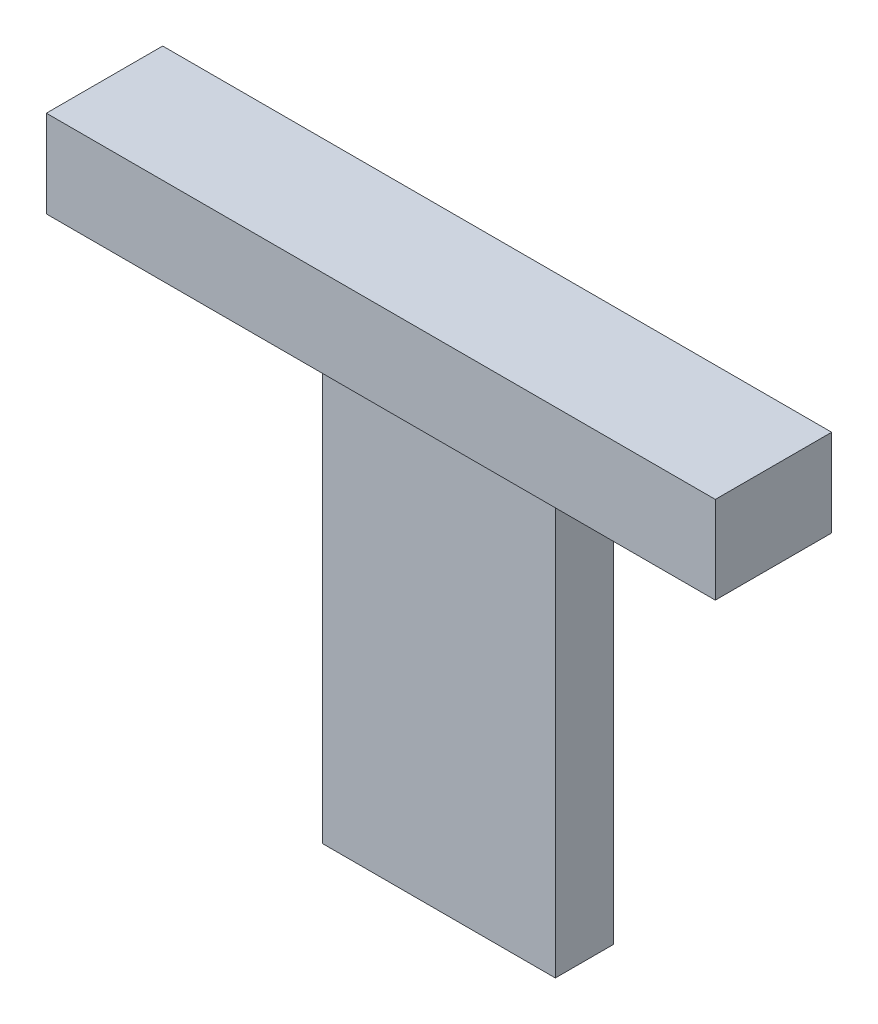
ISO-10303-21;
HEADER;
FILE_DESCRIPTION(('STEP AP214'),'2;1');
FILE_NAME('part.step','',(''),(''),'','','');
FILE_SCHEMA(('AUTOMOTIVE_DESIGN { 1 0 10303 214 1 1 1 1 }'));
ENDSEC;
DATA;
#1=APPLICATION_CONTEXT('core data for automotive mechanical design processes');
#2=APPLICATION_PROTOCOL_DEFINITION('international standard','automotive_design',2000,#1);
#3=PRODUCT_CONTEXT('',#1,'mechanical');
#4=PRODUCT('Part','Part','',(#3));
#5=PRODUCT_RELATED_PRODUCT_CATEGORY('part','',(#4));
#6=PRODUCT_DEFINITION_FORMATION('','',#4);
#7=PRODUCT_DEFINITION_CONTEXT('part definition',#1,'design');
#8=PRODUCT_DEFINITION('design','',#6,#7);
#9=PRODUCT_DEFINITION_SHAPE('','',#8);
#10=(LENGTH_UNIT() NAMED_UNIT(*) SI_UNIT(.MILLI.,.METRE.));
#11=(NAMED_UNIT(*) PLANE_ANGLE_UNIT() SI_UNIT($,.RADIAN.));
#12=(NAMED_UNIT(*) SI_UNIT($,.STERADIAN.) SOLID_ANGLE_UNIT());
#13=UNCERTAINTY_MEASURE_WITH_UNIT(LENGTH_MEASURE(1.E-05),#10,'distance_accuracy_value','');
#14=(GEOMETRIC_REPRESENTATION_CONTEXT(3) GLOBAL_UNCERTAINTY_ASSIGNED_CONTEXT((#13)) GLOBAL_UNIT_ASSIGNED_CONTEXT((#10,
#11,#12)) REPRESENTATION_CONTEXT('',''));
#15=CARTESIAN_POINT('',(0.,0.,0.));
#16=DIRECTION('',(0.,0.,1.));
#17=DIRECTION('',(1.,0.,0.));
#18=AXIS2_PLACEMENT_3D('',#15,#16,#17);
#19=CARTESIAN_POINT('',(0.,-80.,20.));
#20=DIRECTION('',(0.,1.,0.));
#21=DIRECTION('',(0.,0.,1.));
#22=AXIS2_PLACEMENT_3D('',#19,#20,#21);
#23=PLANE('',#22);
#24=DIRECTION('',(1.,0.,0.));
#25=VECTOR('',#24,1.);
#26=CARTESIAN_POINT('',(0.,-80.,0.));
#27=LINE('',#26,#25);
#28=CARTESIAN_POINT('',(-40.,-80.,0.));
#29=VERTEX_POINT('',#28);
#30=CARTESIAN_POINT('',(40.,-80.,0.));
#31=VERTEX_POINT('',#30);
#32=EDGE_CURVE('E130',#29,#31,#27,.T.);
#33=ORIENTED_EDGE('',*,*,#32,.T.);
#34=DIRECTION('',(0.,0.,-1.));
#35=VECTOR('',#34,1.);
#36=CARTESIAN_POINT('',(40.,-80.,20.));
#37=LINE('',#36,#35);
#38=CARTESIAN_POINT('',(40.,-80.,20.));
#39=VERTEX_POINT('',#38);
#40=EDGE_CURVE('E11',#39,#31,#37,.T.);
#41=ORIENTED_EDGE('',*,*,#40,.F.);
#42=DIRECTION('',(1.,0.,0.));
#43=VECTOR('',#42,1.);
#44=CARTESIAN_POINT('',(0.,-80.,20.));
#45=LINE('',#44,#43);
#46=CARTESIAN_POINT('',(-40.,-80.,20.));
#47=VERTEX_POINT('',#46);
#48=EDGE_CURVE('E138',#47,#39,#45,.T.);
#49=ORIENTED_EDGE('',*,*,#48,.F.);
#50=DIRECTION('',(0.,0.,-1.));
#51=VECTOR('',#50,1.);
#52=CARTESIAN_POINT('',(-40.,-80.,20.));
#53=LINE('',#52,#51);
#54=EDGE_CURVE('E49',#47,#29,#53,.T.);
#55=ORIENTED_EDGE('',*,*,#54,.T.);
#56=EDGE_LOOP('',(#33,#41,#49,#55));
#57=FACE_BOUND('',#56,.T.);
#58=ADVANCED_FACE('F33',(#57),#23,.F.);
#59=CARTESIAN_POINT('',(40.,0.,20.));
#60=DIRECTION('',(-1.,0.,0.));
#61=DIRECTION('',(0.,-1.,0.));
#62=AXIS2_PLACEMENT_3D('',#59,#60,#61);
#63=PLANE('',#62);
#64=DIRECTION('',(0.,1.,0.));
#65=VECTOR('',#64,1.);
#66=CARTESIAN_POINT('',(40.,0.,0.));
#67=LINE('',#66,#65);
#68=CARTESIAN_POINT('',(40.,80.,0.));
#69=VERTEX_POINT('',#68);
#70=EDGE_CURVE('E132',#31,#69,#67,.T.);
#71=ORIENTED_EDGE('',*,*,#70,.T.);
#72=DIRECTION('',(0.,0.,-1.));
#73=VECTOR('',#72,1.);
#74=CARTESIAN_POINT('',(40.,80.,20.));
#75=LINE('',#74,#73);
#76=CARTESIAN_POINT('',(40.,80.,20.));
#77=VERTEX_POINT('',#76);
#78=EDGE_CURVE('E41',#77,#69,#75,.T.);
#79=ORIENTED_EDGE('',*,*,#78,.F.);
#80=DIRECTION('',(0.,1.,0.));
#81=VECTOR('',#80,1.);
#82=CARTESIAN_POINT('',(40.,0.,20.));
#83=LINE('',#82,#81);
#84=EDGE_CURVE('E73',#39,#77,#83,.T.);
#85=ORIENTED_EDGE('',*,*,#84,.F.);
#86=ORIENTED_EDGE('',*,*,#40,.T.);
#87=EDGE_LOOP('',(#71,#79,#85,#86));
#88=FACE_BOUND('',#87,.T.);
#89=ADVANCED_FACE('F176',(#88),#63,.F.);
#90=CARTESIAN_POINT('',(-40.,0.,20.));
#91=DIRECTION('',(-1.,0.,0.));
#92=DIRECTION('',(0.,-1.,0.));
#93=AXIS2_PLACEMENT_3D('',#90,#91,#92);
#94=PLANE('',#93);
#95=DIRECTION('',(0.,1.,0.));
#96=VECTOR('',#95,1.);
#97=CARTESIAN_POINT('',(-40.,0.,0.));
#98=LINE('',#97,#96);
#99=CARTESIAN_POINT('',(-40.,80.,0.));
#100=VERTEX_POINT('',#99);
#101=EDGE_CURVE('E140',#29,#100,#98,.T.);
#102=ORIENTED_EDGE('',*,*,#101,.F.);
#103=ORIENTED_EDGE('',*,*,#54,.F.);
#104=DIRECTION('',(0.,1.,0.));
#105=VECTOR('',#104,1.);
#106=CARTESIAN_POINT('',(-40.,0.,20.));
#107=LINE('',#106,#105);
#108=CARTESIAN_POINT('',(-40.,80.,20.));
#109=VERTEX_POINT('',#108);
#110=EDGE_CURVE('E145',#47,#109,#107,.T.);
#111=ORIENTED_EDGE('',*,*,#110,.T.);
#112=DIRECTION('',(0.,0.,-1.));
#113=VECTOR('',#112,1.);
#114=CARTESIAN_POINT('',(-40.,80.,20.));
#115=LINE('',#114,#113);
#116=EDGE_CURVE('E62',#109,#100,#115,.T.);
#117=ORIENTED_EDGE('',*,*,#116,.T.);
#118=EDGE_LOOP('',(#102,#103,#111,#117));
#119=FACE_BOUND('',#118,.T.);
#120=ADVANCED_FACE('F173',(#119),#94,.T.);
#121=CARTESIAN_POINT('',(0.,0.,20.));
#122=DIRECTION('',(0.,0.,1.));
#123=DIRECTION('',(1.,0.,0.));
#124=AXIS2_PLACEMENT_3D('',#121,#122,#123);
#125=PLANE('',#124);
#126=ORIENTED_EDGE('',*,*,#48,.T.);
#127=ORIENTED_EDGE('',*,*,#84,.T.);
#128=DIRECTION('',(1.,0.,0.));
#129=VECTOR('',#128,1.);
#130=CARTESIAN_POINT('',(0.,80.,20.));
#131=LINE('',#130,#129);
#132=EDGE_CURVE('E142',#109,#77,#131,.T.);
#133=ORIENTED_EDGE('',*,*,#132,.F.);
#134=ORIENTED_EDGE('',*,*,#110,.F.);
#135=EDGE_LOOP('',(#126,#127,#133,#134));
#136=FACE_BOUND('',#135,.T.);
#137=ADVANCED_FACE('F175',(#136),#125,.T.);
#138=CARTESIAN_POINT('',(0.,0.,0.));
#139=DIRECTION('',(0.,0.,1.));
#140=DIRECTION('',(1.,0.,0.));
#141=AXIS2_PLACEMENT_3D('',#138,#139,#140);
#142=PLANE('',#141);
#143=ORIENTED_EDGE('',*,*,#32,.F.);
#144=ORIENTED_EDGE('',*,*,#101,.T.);
#145=DIRECTION('',(1.,0.,0.));
#146=VECTOR('',#145,1.);
#147=CARTESIAN_POINT('',(0.,80.,0.));
#148=LINE('',#147,#146);
#149=CARTESIAN_POINT('',(-115.,80.,0.));
#150=VERTEX_POINT('',#149);
#151=EDGE_CURVE('E154',#150,#100,#148,.T.);
#152=ORIENTED_EDGE('',*,*,#151,.F.);
#153=DIRECTION('',(0.,1.,0.));
#154=VECTOR('',#153,1.);
#155=CARTESIAN_POINT('',(-115.,0.,0.));
#156=LINE('',#155,#154);
#157=CARTESIAN_POINT('',(-115.,110.,0.));
#158=VERTEX_POINT('',#157);
#159=EDGE_CURVE('E123',#150,#158,#156,.T.);
#160=ORIENTED_EDGE('',*,*,#159,.T.);
#161=DIRECTION('',(1.,0.,0.));
#162=VECTOR('',#161,1.);
#163=CARTESIAN_POINT('',(0.,110.,0.));
#164=LINE('',#163,#162);
#165=CARTESIAN_POINT('',(115.,110.,0.));
#166=VERTEX_POINT('',#165);
#167=EDGE_CURVE('E161',#158,#166,#164,.T.);
#168=ORIENTED_EDGE('',*,*,#167,.T.);
#169=DIRECTION('',(0.,1.,0.));
#170=VECTOR('',#169,1.);
#171=CARTESIAN_POINT('',(115.,0.,0.));
#172=LINE('',#171,#170);
#173=CARTESIAN_POINT('',(115.,80.,0.));
#174=VERTEX_POINT('',#173);
#175=EDGE_CURVE('E153',#174,#166,#172,.T.);
#176=ORIENTED_EDGE('',*,*,#175,.F.);
#177=EDGE_CURVE('E128',#69,#174,#148,.T.);
#178=ORIENTED_EDGE('',*,*,#177,.F.);
#179=ORIENTED_EDGE('',*,*,#70,.F.);
#180=EDGE_LOOP('',(#143,#144,#152,#160,#168,#176,#178,#179));
#181=FACE_BOUND('',#180,.T.);
#182=ADVANCED_FACE('F151',(#181),#142,.F.);
#183=CARTESIAN_POINT('',(0.,80.,40.));
#184=DIRECTION('',(0.,1.,0.));
#185=DIRECTION('',(0.,0.,1.));
#186=AXIS2_PLACEMENT_3D('',#183,#184,#185);
#187=PLANE('',#186);
#188=ORIENTED_EDGE('',*,*,#116,.F.);
#189=ORIENTED_EDGE('',*,*,#132,.T.);
#190=ORIENTED_EDGE('',*,*,#78,.T.);
#191=ORIENTED_EDGE('',*,*,#177,.T.);
#192=DIRECTION('',(0.,0.,-1.));
#193=VECTOR('',#192,1.);
#194=CARTESIAN_POINT('',(115.,80.,40.));
#195=LINE('',#194,#193);
#196=CARTESIAN_POINT('',(115.,80.,40.));
#197=VERTEX_POINT('',#196);
#198=EDGE_CURVE('E109',#197,#174,#195,.T.);
#199=ORIENTED_EDGE('',*,*,#198,.F.);
#200=DIRECTION('',(1.,0.,0.));
#201=VECTOR('',#200,1.);
#202=CARTESIAN_POINT('',(0.,80.,40.));
#203=LINE('',#202,#201);
#204=CARTESIAN_POINT('',(-115.,80.,40.));
#205=VERTEX_POINT('',#204);
#206=EDGE_CURVE('E115',#205,#197,#203,.T.);
#207=ORIENTED_EDGE('',*,*,#206,.F.);
#208=DIRECTION('',(0.,0.,-1.));
#209=VECTOR('',#208,1.);
#210=CARTESIAN_POINT('',(-115.,80.,40.));
#211=LINE('',#210,#209);
#212=EDGE_CURVE('E165',#205,#150,#211,.T.);
#213=ORIENTED_EDGE('',*,*,#212,.T.);
#214=ORIENTED_EDGE('',*,*,#151,.T.);
#215=EDGE_LOOP('',(#188,#189,#190,#191,#199,#207,#213,#214));
#216=FACE_BOUND('',#215,.T.);
#217=ADVANCED_FACE('F125',(#216),#187,.F.);
#218=CARTESIAN_POINT('',(115.,0.,40.));
#219=DIRECTION('',(-1.,0.,0.));
#220=DIRECTION('',(0.,0.,1.));
#221=AXIS2_PLACEMENT_3D('',#218,#219,#220);
#222=PLANE('',#221);
#223=ORIENTED_EDGE('',*,*,#175,.T.);
#224=DIRECTION('',(0.,0.,-1.));
#225=VECTOR('',#224,1.);
#226=CARTESIAN_POINT('',(115.,110.,40.));
#227=LINE('',#226,#225);
#228=CARTESIAN_POINT('',(115.,110.,40.));
#229=VERTEX_POINT('',#228);
#230=EDGE_CURVE('E110',#229,#166,#227,.T.);
#231=ORIENTED_EDGE('',*,*,#230,.F.);
#232=DIRECTION('',(0.,1.,0.));
#233=VECTOR('',#232,1.);
#234=CARTESIAN_POINT('',(115.,0.,40.));
#235=LINE('',#234,#233);
#236=EDGE_CURVE('E104',#197,#229,#235,.T.);
#237=ORIENTED_EDGE('',*,*,#236,.F.);
#238=ORIENTED_EDGE('',*,*,#198,.T.);
#239=EDGE_LOOP('',(#223,#231,#237,#238));
#240=FACE_BOUND('',#239,.T.);
#241=ADVANCED_FACE('F107',(#240),#222,.F.);
#242=CARTESIAN_POINT('',(0.,110.,40.));
#243=DIRECTION('',(0.,1.,0.));
#244=DIRECTION('',(0.,0.,1.));
#245=AXIS2_PLACEMENT_3D('',#242,#243,#244);
#246=PLANE('',#245);
#247=ORIENTED_EDGE('',*,*,#167,.F.);
#248=DIRECTION('',(0.,0.,-1.));
#249=VECTOR('',#248,1.);
#250=CARTESIAN_POINT('',(-115.,110.,40.));
#251=LINE('',#250,#249);
#252=CARTESIAN_POINT('',(-115.,110.,40.));
#253=VERTEX_POINT('',#252);
#254=EDGE_CURVE('E134',#253,#158,#251,.T.);
#255=ORIENTED_EDGE('',*,*,#254,.F.);
#256=DIRECTION('',(1.,0.,0.));
#257=VECTOR('',#256,1.);
#258=CARTESIAN_POINT('',(0.,110.,40.));
#259=LINE('',#258,#257);
#260=EDGE_CURVE('E114',#253,#229,#259,.T.);
#261=ORIENTED_EDGE('',*,*,#260,.T.);
#262=ORIENTED_EDGE('',*,*,#230,.T.);
#263=EDGE_LOOP('',(#247,#255,#261,#262));
#264=FACE_BOUND('',#263,.T.);
#265=ADVANCED_FACE('F171',(#264),#246,.T.);
#266=CARTESIAN_POINT('',(-115.,0.,40.));
#267=DIRECTION('',(-1.,0.,0.));
#268=DIRECTION('',(0.,0.,1.));
#269=AXIS2_PLACEMENT_3D('',#266,#267,#268);
#270=PLANE('',#269);
#271=ORIENTED_EDGE('',*,*,#159,.F.);
#272=ORIENTED_EDGE('',*,*,#212,.F.);
#273=DIRECTION('',(0.,1.,0.));
#274=VECTOR('',#273,1.);
#275=CARTESIAN_POINT('',(-115.,0.,40.));
#276=LINE('',#275,#274);
#277=EDGE_CURVE('E121',#205,#253,#276,.T.);
#278=ORIENTED_EDGE('',*,*,#277,.T.);
#279=ORIENTED_EDGE('',*,*,#254,.T.);
#280=EDGE_LOOP('',(#271,#272,#278,#279));
#281=FACE_BOUND('',#280,.T.);
#282=ADVANCED_FACE('F169',(#281),#270,.T.);
#283=CARTESIAN_POINT('',(0.,0.,40.));
#284=DIRECTION('',(0.,0.,1.));
#285=DIRECTION('',(1.,0.,0.));
#286=AXIS2_PLACEMENT_3D('',#283,#284,#285);
#287=PLANE('',#286);
#288=ORIENTED_EDGE('',*,*,#206,.T.);
#289=ORIENTED_EDGE('',*,*,#236,.T.);
#290=ORIENTED_EDGE('',*,*,#260,.F.);
#291=ORIENTED_EDGE('',*,*,#277,.F.);
#292=EDGE_LOOP('',(#288,#289,#290,#291));
#293=FACE_BOUND('',#292,.T.);
#294=ADVANCED_FACE('F119',(#293),#287,.T.);
#295=CLOSED_SHELL('',(#58,#89,#120,#137,#182,#217,#241,#265,#282,#294));
#296=MANIFOLD_SOLID_BREP('B2',#295);
#297=ADVANCED_BREP_SHAPE_REPRESENTATION('',(#18,#296),#14);
#298=SHAPE_DEFINITION_REPRESENTATION(#9,#297);
ENDSEC;
END-ISO-10303-21;
